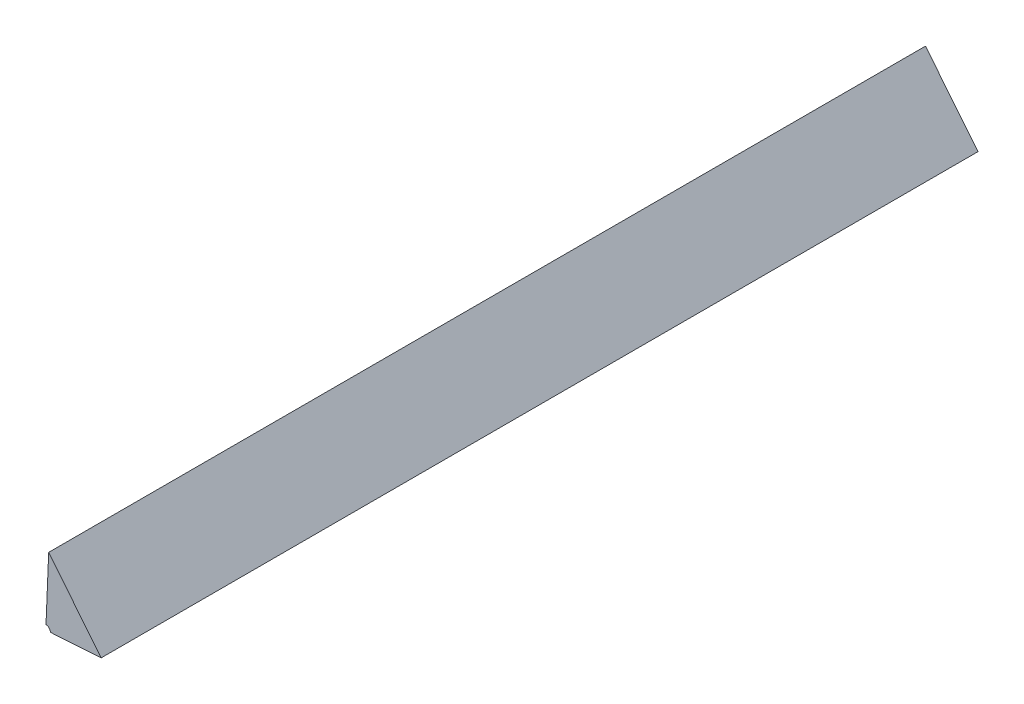
ISO-10303-21;
HEADER;
FILE_DESCRIPTION(('STEP AP214'),'2;1');
FILE_NAME('part.step','',(''),(''),'','','');
FILE_SCHEMA(('AUTOMOTIVE_DESIGN { 1 0 10303 214 1 1 1 1 }'));
ENDSEC;
DATA;
#1=APPLICATION_CONTEXT('core data for automotive mechanical design processes');
#2=APPLICATION_PROTOCOL_DEFINITION('international standard','automotive_design',2000,#1);
#3=PRODUCT_CONTEXT('',#1,'mechanical');
#4=PRODUCT('Part','Part','',(#3));
#5=PRODUCT_RELATED_PRODUCT_CATEGORY('part','',(#4));
#6=PRODUCT_DEFINITION_FORMATION('','',#4);
#7=PRODUCT_DEFINITION_CONTEXT('part definition',#1,'design');
#8=PRODUCT_DEFINITION('design','',#6,#7);
#9=PRODUCT_DEFINITION_SHAPE('','',#8);
#10=(LENGTH_UNIT() NAMED_UNIT(*) SI_UNIT(.MILLI.,.METRE.));
#11=(NAMED_UNIT(*) PLANE_ANGLE_UNIT() SI_UNIT($,.RADIAN.));
#12=(NAMED_UNIT(*) SI_UNIT($,.STERADIAN.) SOLID_ANGLE_UNIT());
#13=UNCERTAINTY_MEASURE_WITH_UNIT(LENGTH_MEASURE(1.E-05),#10,'distance_accuracy_value','');
#14=(GEOMETRIC_REPRESENTATION_CONTEXT(3) GLOBAL_UNCERTAINTY_ASSIGNED_CONTEXT((#13)) GLOBAL_UNIT_ASSIGNED_CONTEXT((#10,
#11,#12)) REPRESENTATION_CONTEXT('',''));
#15=CARTESIAN_POINT('',(0.,0.,0.));
#16=DIRECTION('',(0.,0.,1.));
#17=DIRECTION('',(1.,0.,0.));
#18=AXIS2_PLACEMENT_3D('',#15,#16,#17);
#19=CARTESIAN_POINT('',(-1.2846342454945,-0.395520360951848,0.1));
#20=DIRECTION('',(0.,0.,1.));
#21=DIRECTION('',(1.,0.,0.));
#22=AXIS2_PLACEMENT_3D('',#19,#20,#21);
#23=PLANE('',#22);
#24=DIRECTION('',(0.,-1.,0.));
#25=VECTOR('',#24,1.);
#26=CARTESIAN_POINT('',(-1.2868726607526,-0.390354849213328,0.1));
#27=LINE('',#26,#25);
#28=CARTESIAN_POINT('',(-1.2865674908471,-0.390747010557731,0.1));
#29=VERTEX_POINT('',#28);
#30=CARTESIAN_POINT('',(-1.2868726607526,-0.398046889036204,0.1));
#31=VERTEX_POINT('',#30);
#32=EDGE_CURVE('E11',#29,#31,#27,.T.);
#33=ORIENTED_EDGE('',*,*,#32,.T.);
#34=CARTESIAN_POINT('',(-1.2868726607526,-0.398546889036204,0.1));
#35=DIRECTION('',(0.,0.,-1.));
#36=DIRECTION('',(-1.,0.,0.));
#37=AXIS2_PLACEMENT_3D('',#34,#35,#36);
#38=CIRCLE('',#37,0.0005);
#39=CARTESIAN_POINT('',(-1.2863726607526,-0.398546889036204,0.1));
#40=VERTEX_POINT('',#39);
#41=EDGE_CURVE('E24',#31,#40,#38,.T.);
#42=ORIENTED_EDGE('',*,*,#41,.T.);
#43=DIRECTION('',(1.,0.,0.));
#44=VECTOR('',#43,1.);
#45=CARTESIAN_POINT('',(-1.2868726607526,-0.398546889036204,0.1));
#46=LINE('',#45,#44);
#47=CARTESIAN_POINT('',(-1.2805800702579,-0.398176901335756,0.1));
#48=VERTEX_POINT('',#47);
#49=EDGE_CURVE('E59',#40,#48,#46,.T.);
#50=ORIENTED_EDGE('',*,*,#49,.T.);
#51=DIRECTION('',(-0.628289208450198,0.777979865128284,0.));
#52=VECTOR('',#51,1.);
#53=CARTESIAN_POINT('',(-1.2802568465823,-0.398546889036204,0.1));
#54=LINE('',#53,#52);
#55=EDGE_CURVE('E134',#48,#29,#54,.T.);
#56=ORIENTED_EDGE('',*,*,#55,.T.);
#57=EDGE_LOOP('',(#33,#42,#50,#56));
#58=FACE_BOUND('',#57,.T.);
#59=ADVANCED_FACE('F17',(#58),#23,.T.);
#60=CARTESIAN_POINT('',(-1.2802568465823,-0.398546889036204,0.));
#61=DIRECTION('',(0.777979865128284,0.628289208450198,0.));
#62=DIRECTION('',(-0.628289208450198,0.777979865128284,0.));
#63=AXIS2_PLACEMENT_3D('',#60,#61,#62);
#64=PLANE('',#63);
#65=CARTESIAN_POINT('',(-1.28655851614835,-0.390743839145894,0.));
#66=DIRECTION('',(0.,0.,1.));
#67=VECTOR('',#66,1.);
#68=LINE('',#65,#67);
#69=CARTESIAN_POINT('',(-1.2865674908471,-0.390747010557731,0.));
#70=VERTEX_POINT('',#69);
#71=EDGE_CURVE('E120',#70,#29,#68,.T.);
#72=ORIENTED_EDGE('',*,*,#71,.T.);
#73=ORIENTED_EDGE('',*,*,#55,.F.);
#74=CARTESIAN_POINT('',(-1.28057099118653,-0.398157899103637,0.1));
#75=DIRECTION('',(0.,0.,-1.));
#76=VECTOR('',#75,1.);
#77=LINE('',#74,#76);
#78=CARTESIAN_POINT('',(-1.2805800702579,-0.398176901335756,0.));
#79=VERTEX_POINT('',#78);
#80=EDGE_CURVE('E87',#48,#79,#77,.T.);
#81=ORIENTED_EDGE('',*,*,#80,.T.);
#82=DIRECTION('',(-0.628289208450198,0.777979865128284,0.));
#83=VECTOR('',#82,1.);
#84=CARTESIAN_POINT('',(-1.2802568465823,-0.398546889036204,0.));
#85=LINE('',#84,#83);
#86=EDGE_CURVE('E71',#79,#70,#85,.T.);
#87=ORIENTED_EDGE('',*,*,#86,.T.);
#88=EDGE_LOOP('',(#72,#73,#81,#87));
#89=FACE_BOUND('',#88,.T.);
#90=ADVANCED_FACE('F106',(#89),#64,.T.);
#91=CARTESIAN_POINT('',(-1.2868726607526,-0.390354849213328,0.));
#92=DIRECTION('',(-1.,0.,0.));
#93=DIRECTION('',(0.,-1.,0.));
#94=AXIS2_PLACEMENT_3D('',#91,#92,#93);
#95=PLANE('',#94);
#96=DIRECTION('',(0.,0.,1.));
#97=VECTOR('',#96,1.);
#98=CARTESIAN_POINT('',(-1.2868726607526,-0.398046889036204,0.1));
#99=LINE('',#98,#97);
#100=CARTESIAN_POINT('',(-1.2868726607526,-0.398046889036204,0.));
#101=VERTEX_POINT('',#100);
#102=EDGE_CURVE('E74',#101,#31,#99,.T.);
#103=ORIENTED_EDGE('',*,*,#102,.T.);
#104=ORIENTED_EDGE('',*,*,#32,.F.);
#105=ORIENTED_EDGE('',*,*,#71,.F.);
#106=DIRECTION('',(0.,-1.,0.));
#107=VECTOR('',#106,1.);
#108=CARTESIAN_POINT('',(-1.2868726607526,-0.390354849213328,0.));
#109=LINE('',#108,#107);
#110=EDGE_CURVE('E62',#70,#101,#109,.T.);
#111=ORIENTED_EDGE('',*,*,#110,.T.);
#112=EDGE_LOOP('',(#103,#104,#105,#111));
#113=FACE_BOUND('',#112,.T.);
#114=ADVANCED_FACE('F102',(#113),#95,.T.);
#115=CARTESIAN_POINT('',(-1.2868726607526,-0.398546889036204,0.));
#116=DIRECTION('',(0.,-1.,0.));
#117=DIRECTION('',(1.,0.,0.));
#118=AXIS2_PLACEMENT_3D('',#115,#116,#117);
#119=PLANE('',#118);
#120=DIRECTION('',(0.,0.,-1.));
#121=VECTOR('',#120,1.);
#122=CARTESIAN_POINT('',(-1.2863726607526,-0.398546889036204,0.1));
#123=LINE('',#122,#121);
#124=CARTESIAN_POINT('',(-1.2863726607526,-0.398546889036204,0.));
#125=VERTEX_POINT('',#124);
#126=EDGE_CURVE('E54',#40,#125,#123,.T.);
#127=ORIENTED_EDGE('',*,*,#126,.T.);
#128=DIRECTION('',(1.,0.,0.));
#129=VECTOR('',#128,1.);
#130=CARTESIAN_POINT('',(-1.2868726607526,-0.398546889036204,0.));
#131=LINE('',#130,#129);
#132=EDGE_CURVE('E58',#125,#79,#131,.T.);
#133=ORIENTED_EDGE('',*,*,#132,.T.);
#134=ORIENTED_EDGE('',*,*,#80,.F.);
#135=ORIENTED_EDGE('',*,*,#49,.F.);
#136=EDGE_LOOP('',(#127,#133,#134,#135));
#137=FACE_BOUND('',#136,.T.);
#138=ADVANCED_FACE('F56',(#137),#119,.T.);
#139=CARTESIAN_POINT('',(-1.2846342454945,-0.395520360951848,0.));
#140=DIRECTION('',(0.,0.,1.));
#141=DIRECTION('',(1.,0.,0.));
#142=AXIS2_PLACEMENT_3D('',#139,#140,#141);
#143=PLANE('',#142);
#144=ORIENTED_EDGE('',*,*,#86,.F.);
#145=ORIENTED_EDGE('',*,*,#132,.F.);
#146=CARTESIAN_POINT('',(-1.2868726607526,-0.398546889036204,0.));
#147=DIRECTION('',(0.,0.,1.));
#148=DIRECTION('',(-1.,0.,0.));
#149=AXIS2_PLACEMENT_3D('',#146,#147,#148);
#150=CIRCLE('',#149,0.0005);
#151=EDGE_CURVE('E69',#125,#101,#150,.T.);
#152=ORIENTED_EDGE('',*,*,#151,.T.);
#153=ORIENTED_EDGE('',*,*,#110,.F.);
#154=EDGE_LOOP('',(#144,#145,#152,#153));
#155=FACE_BOUND('',#154,.T.);
#156=ADVANCED_FACE('F67',(#155),#143,.F.);
#157=CARTESIAN_POINT('',(-1.2868726607526,-0.398546889036204,0.1));
#158=DIRECTION('',(0.,0.,1.));
#159=DIRECTION('',(-1.,0.,0.));
#160=AXIS2_PLACEMENT_3D('',#157,#158,#159);
#161=CYLINDRICAL_SURFACE('',#160,0.0005);
#162=ORIENTED_EDGE('',*,*,#102,.F.);
#163=ORIENTED_EDGE('',*,*,#151,.F.);
#164=ORIENTED_EDGE('',*,*,#126,.F.);
#165=ORIENTED_EDGE('',*,*,#41,.F.);
#166=EDGE_LOOP('',(#162,#163,#164,#165));
#167=FACE_BOUND('',#166,.T.);
#168=ADVANCED_FACE('F73',(#167),#161,.F.);
#169=CLOSED_SHELL('',(#59,#90,#114,#138,#156,#168));
#170=MANIFOLD_SOLID_BREP('B1',#169);
#171=ADVANCED_BREP_SHAPE_REPRESENTATION('',(#18,#170),#14);
#172=SHAPE_DEFINITION_REPRESENTATION(#9,#171);
ENDSEC;
END-ISO-10303-21;
